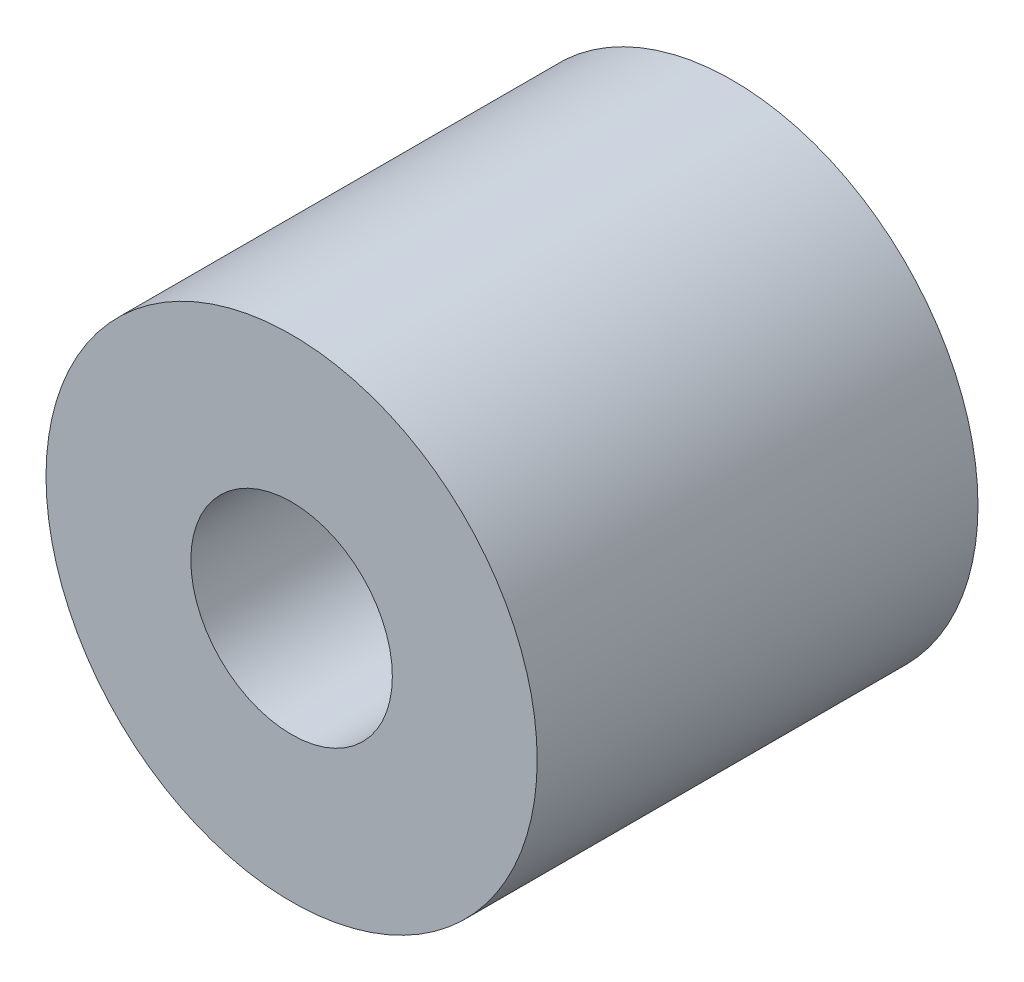
ISO-10303-21;
HEADER;
FILE_DESCRIPTION(('STEP AP214'),'2;1');
FILE_NAME('part.step','',(''),(''),'','','');
FILE_SCHEMA(('AUTOMOTIVE_DESIGN { 1 0 10303 214 1 1 1 1 }'));
ENDSEC;
DATA;
#1=APPLICATION_CONTEXT('core data for automotive mechanical design processes');
#2=APPLICATION_PROTOCOL_DEFINITION('international standard','automotive_design',2000,#1);
#3=PRODUCT_CONTEXT('',#1,'mechanical');
#4=PRODUCT('Part','Part','',(#3));
#5=PRODUCT_RELATED_PRODUCT_CATEGORY('part','',(#4));
#6=PRODUCT_DEFINITION_FORMATION('','',#4);
#7=PRODUCT_DEFINITION_CONTEXT('part definition',#1,'design');
#8=PRODUCT_DEFINITION('design','',#6,#7);
#9=PRODUCT_DEFINITION_SHAPE('','',#8);
#10=(LENGTH_UNIT() NAMED_UNIT(*) SI_UNIT(.MILLI.,.METRE.));
#11=(NAMED_UNIT(*) PLANE_ANGLE_UNIT() SI_UNIT($,.RADIAN.));
#12=(NAMED_UNIT(*) SI_UNIT($,.STERADIAN.) SOLID_ANGLE_UNIT());
#13=UNCERTAINTY_MEASURE_WITH_UNIT(LENGTH_MEASURE(1.E-05),#10,'distance_accuracy_value','');
#14=(GEOMETRIC_REPRESENTATION_CONTEXT(3) GLOBAL_UNCERTAINTY_ASSIGNED_CONTEXT((#13)) GLOBAL_UNIT_ASSIGNED_CONTEXT((#10,
#11,#12)) REPRESENTATION_CONTEXT('',''));
#15=CARTESIAN_POINT('',(0.,0.,0.));
#16=DIRECTION('',(0.,0.,1.));
#17=DIRECTION('',(1.,0.,0.));
#18=AXIS2_PLACEMENT_3D('',#15,#16,#17);
#19=CARTESIAN_POINT('',(0.,0.,0.));
#20=DIRECTION('',(0.,0.,1.));
#21=DIRECTION('',(1.,0.,0.));
#22=AXIS2_PLACEMENT_3D('',#19,#20,#21);
#23=CYLINDRICAL_SURFACE('',#22,1.6);
#24=CARTESIAN_POINT('',(0.,0.,7.));
#25=DIRECTION('',(0.,0.,-1.));
#26=DIRECTION('',(0.,-1.,0.));
#27=AXIS2_PLACEMENT_3D('',#24,#25,#26);
#28=CIRCLE('',#27,1.6);
#29=CARTESIAN_POINT('',(0.,-1.6,7.));
#30=VERTEX_POINT('',#29);
#31=EDGE_CURVE('E9',#30,#30,#28,.T.);
#32=ORIENTED_EDGE('',*,*,#31,.F.);
#33=EDGE_LOOP('',(#32));
#34=FACE_BOUND('',#33,.T.);
#35=CARTESIAN_POINT('',(0.,0.,0.));
#36=DIRECTION('',(0.,0.,1.));
#37=DIRECTION('',(1.,0.,0.));
#38=AXIS2_PLACEMENT_3D('',#35,#36,#37);
#39=CIRCLE('',#38,1.6);
#40=CARTESIAN_POINT('',(1.6,0.,0.));
#41=VERTEX_POINT('',#40);
#42=EDGE_CURVE('E27',#41,#41,#39,.T.);
#43=ORIENTED_EDGE('',*,*,#42,.F.);
#44=EDGE_LOOP('',(#43));
#45=FACE_BOUND('',#44,.T.);
#46=ADVANCED_FACE('F14',(#34,#45),#23,.F.);
#47=CARTESIAN_POINT('',(0.,0.,0.));
#48=DIRECTION('',(0.,0.,1.));
#49=DIRECTION('',(1.,0.,0.));
#50=AXIS2_PLACEMENT_3D('',#47,#48,#49);
#51=CYLINDRICAL_SURFACE('',#50,3.9);
#52=CARTESIAN_POINT('',(0.,0.,7.));
#53=DIRECTION('',(0.,0.,1.));
#54=DIRECTION('',(1.,0.,0.));
#55=AXIS2_PLACEMENT_3D('',#52,#53,#54);
#56=CIRCLE('',#55,3.9);
#57=CARTESIAN_POINT('',(3.9,0.,7.));
#58=VERTEX_POINT('',#57);
#59=EDGE_CURVE('E22',#58,#58,#56,.T.);
#60=ORIENTED_EDGE('',*,*,#59,.F.);
#61=EDGE_LOOP('',(#60));
#62=FACE_BOUND('',#61,.T.);
#63=CARTESIAN_POINT('',(0.,0.,0.));
#64=DIRECTION('',(0.,0.,-1.));
#65=DIRECTION('',(0.,-1.,0.));
#66=AXIS2_PLACEMENT_3D('',#63,#64,#65);
#67=CIRCLE('',#66,3.9);
#68=CARTESIAN_POINT('',(0.,-3.9,0.));
#69=VERTEX_POINT('',#68);
#70=EDGE_CURVE('E18',#69,#69,#67,.T.);
#71=ORIENTED_EDGE('',*,*,#70,.F.);
#72=EDGE_LOOP('',(#71));
#73=FACE_BOUND('',#72,.T.);
#74=ADVANCED_FACE('F16',(#62,#73),#51,.T.);
#75=CARTESIAN_POINT('',(0.,0.,7.));
#76=DIRECTION('',(0.,0.,1.));
#77=DIRECTION('',(1.,0.,0.));
#78=AXIS2_PLACEMENT_3D('',#75,#76,#77);
#79=PLANE('',#78);
#80=ORIENTED_EDGE('',*,*,#31,.T.);
#81=EDGE_LOOP('',(#80));
#82=FACE_BOUND('',#81,.T.);
#83=ORIENTED_EDGE('',*,*,#59,.T.);
#84=EDGE_LOOP('',(#83));
#85=FACE_BOUND('',#84,.T.);
#86=ADVANCED_FACE('F38',(#82,#85),#79,.T.);
#87=CARTESIAN_POINT('',(0.,0.,0.));
#88=DIRECTION('',(0.,0.,1.));
#89=DIRECTION('',(1.,0.,0.));
#90=AXIS2_PLACEMENT_3D('',#87,#88,#89);
#91=PLANE('',#90);
#92=ORIENTED_EDGE('',*,*,#42,.T.);
#93=EDGE_LOOP('',(#92));
#94=FACE_BOUND('',#93,.T.);
#95=ORIENTED_EDGE('',*,*,#70,.T.);
#96=EDGE_LOOP('',(#95));
#97=FACE_BOUND('',#96,.T.);
#98=ADVANCED_FACE('F35',(#94,#97),#91,.F.);
#99=CLOSED_SHELL('',(#46,#74,#86,#98));
#100=MANIFOLD_SOLID_BREP('B1',#99);
#101=ADVANCED_BREP_SHAPE_REPRESENTATION('',(#18,#100),#14);
#102=SHAPE_DEFINITION_REPRESENTATION(#9,#101);
ENDSEC;
END-ISO-10303-21;
